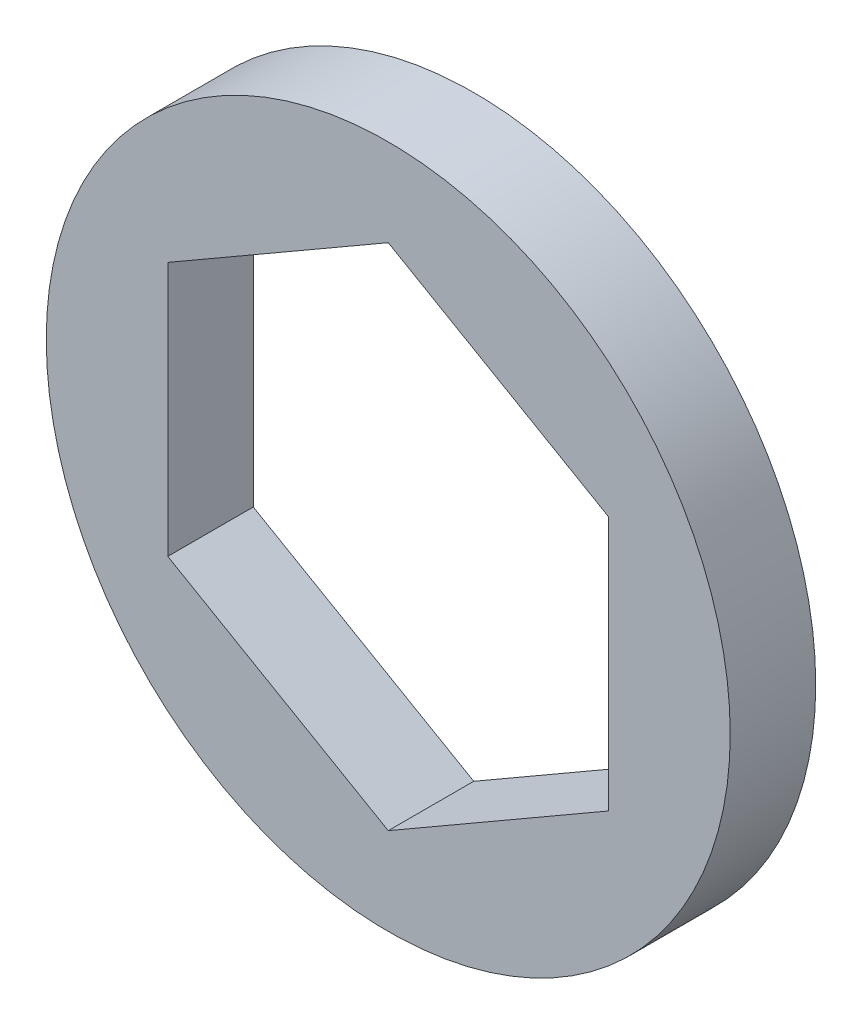
ISO-10303-21;
HEADER;
FILE_DESCRIPTION(('STEP AP214'),'2;1');
FILE_NAME('part.step','',(''),(''),'','','');
FILE_SCHEMA(('AUTOMOTIVE_DESIGN { 1 0 10303 214 1 1 1 1 }'));
ENDSEC;
DATA;
#1=APPLICATION_CONTEXT('core data for automotive mechanical design processes');
#2=APPLICATION_PROTOCOL_DEFINITION('international standard','automotive_design',2000,#1);
#3=PRODUCT_CONTEXT('',#1,'mechanical');
#4=PRODUCT('Part','Part','',(#3));
#5=PRODUCT_RELATED_PRODUCT_CATEGORY('part','',(#4));
#6=PRODUCT_DEFINITION_FORMATION('','',#4);
#7=PRODUCT_DEFINITION_CONTEXT('part definition',#1,'design');
#8=PRODUCT_DEFINITION('design','',#6,#7);
#9=PRODUCT_DEFINITION_SHAPE('','',#8);
#10=(LENGTH_UNIT() NAMED_UNIT(*) SI_UNIT(.MILLI.,.METRE.));
#11=(NAMED_UNIT(*) PLANE_ANGLE_UNIT() SI_UNIT($,.RADIAN.));
#12=(NAMED_UNIT(*) SI_UNIT($,.STERADIAN.) SOLID_ANGLE_UNIT());
#13=UNCERTAINTY_MEASURE_WITH_UNIT(LENGTH_MEASURE(1.E-05),#10,'distance_accuracy_value','');
#14=(GEOMETRIC_REPRESENTATION_CONTEXT(3) GLOBAL_UNCERTAINTY_ASSIGNED_CONTEXT((#13)) GLOBAL_UNIT_ASSIGNED_CONTEXT((#10,
#11,#12)) REPRESENTATION_CONTEXT('',''));
#15=CARTESIAN_POINT('',(0.,0.,0.));
#16=DIRECTION('',(0.,0.,1.));
#17=DIRECTION('',(1.,0.,0.));
#18=AXIS2_PLACEMENT_3D('',#15,#16,#17);
#19=CARTESIAN_POINT('',(0.,0.,2.54));
#20=DIRECTION('',(0.,0.,1.));
#21=DIRECTION('',(1.,0.,0.));
#22=AXIS2_PLACEMENT_3D('',#19,#20,#21);
#23=PLANE('',#22);
#24=CARTESIAN_POINT('',(0.,0.,2.54));
#25=DIRECTION('',(0.,0.,1.));
#26=DIRECTION('',(1.,0.,0.));
#27=AXIS2_PLACEMENT_3D('',#24,#25,#26);
#28=CIRCLE('',#27,10.16);
#29=CARTESIAN_POINT('',(10.16,0.,2.54));
#30=VERTEX_POINT('',#29);
#31=EDGE_CURVE('E11',#30,#30,#28,.T.);
#32=ORIENTED_EDGE('',*,*,#31,.T.);
#33=EDGE_LOOP('',(#32));
#34=FACE_BOUND('',#33,.T.);
#35=DIRECTION('',(-0.866025403784439,-0.5,0.));
#36=VECTOR('',#35,1.);
#37=CARTESIAN_POINT('',(0.,7.5632885263841,2.54));
#38=LINE('',#37,#36);
#39=CARTESIAN_POINT('',(0.,7.5632885263841,2.54));
#40=VERTEX_POINT('',#39);
#41=CARTESIAN_POINT('',(-6.55,3.78164426319205,2.54));
#42=VERTEX_POINT('',#41);
#43=EDGE_CURVE('E102',#40,#42,#38,.T.);
#44=ORIENTED_EDGE('',*,*,#43,.F.);
#45=DIRECTION('',(-0.866025403784439,0.5,0.));
#46=VECTOR('',#45,1.);
#47=CARTESIAN_POINT('',(6.55,3.78164426319205,2.54));
#48=LINE('',#47,#46);
#49=CARTESIAN_POINT('',(6.55,3.78164426319205,2.54));
#50=VERTEX_POINT('',#49);
#51=EDGE_CURVE('E93',#50,#40,#48,.T.);
#52=ORIENTED_EDGE('',*,*,#51,.F.);
#53=DIRECTION('',(0.,1.,0.));
#54=VECTOR('',#53,1.);
#55=CARTESIAN_POINT('',(6.55,-3.78164426319205,2.54));
#56=LINE('',#55,#54);
#57=CARTESIAN_POINT('',(6.55,-3.78164426319205,2.54));
#58=VERTEX_POINT('',#57);
#59=EDGE_CURVE('E127',#58,#50,#56,.T.);
#60=ORIENTED_EDGE('',*,*,#59,.F.);
#61=DIRECTION('',(0.866025403784439,0.5,0.));
#62=VECTOR('',#61,1.);
#63=CARTESIAN_POINT('',(0.,-7.5632885263841,2.54));
#64=LINE('',#63,#62);
#65=CARTESIAN_POINT('',(0.,-7.5632885263841,2.54));
#66=VERTEX_POINT('',#65);
#67=EDGE_CURVE('E124',#66,#58,#64,.T.);
#68=ORIENTED_EDGE('',*,*,#67,.F.);
#69=DIRECTION('',(0.866025403784438,-0.5,0.));
#70=VECTOR('',#69,1.);
#71=CARTESIAN_POINT('',(-6.55000000000001,-3.78164426319205,2.54));
#72=LINE('',#71,#70);
#73=CARTESIAN_POINT('',(-6.55000000000001,-3.78164426319205,2.54));
#74=VERTEX_POINT('',#73);
#75=EDGE_CURVE('E119',#74,#66,#72,.T.);
#76=ORIENTED_EDGE('',*,*,#75,.F.);
#77=DIRECTION('',(0.,-1.,0.));
#78=VECTOR('',#77,1.);
#79=CARTESIAN_POINT('',(-6.55,3.78164426319205,2.54));
#80=LINE('',#79,#78);
#81=EDGE_CURVE('E115',#42,#74,#80,.T.);
#82=ORIENTED_EDGE('',*,*,#81,.F.);
#83=EDGE_LOOP('',(#44,#52,#60,#68,#76,#82));
#84=FACE_BOUND('',#83,.T.);
#85=ADVANCED_FACE('F39',(#34,#84),#23,.T.);
#86=CARTESIAN_POINT('',(0.,0.,0.));
#87=DIRECTION('',(0.,0.,1.));
#88=DIRECTION('',(1.,0.,0.));
#89=AXIS2_PLACEMENT_3D('',#86,#87,#88);
#90=PLANE('',#89);
#91=CARTESIAN_POINT('',(0.,0.,0.));
#92=DIRECTION('',(0.,0.,1.));
#93=DIRECTION('',(1.,0.,0.));
#94=AXIS2_PLACEMENT_3D('',#91,#92,#93);
#95=CIRCLE('',#94,10.16);
#96=CARTESIAN_POINT('',(10.16,0.,0.));
#97=VERTEX_POINT('',#96);
#98=EDGE_CURVE('E43',#97,#97,#95,.T.);
#99=ORIENTED_EDGE('',*,*,#98,.F.);
#100=EDGE_LOOP('',(#99));
#101=FACE_BOUND('',#100,.T.);
#102=DIRECTION('',(-0.866025403784439,0.5,0.));
#103=VECTOR('',#102,1.);
#104=CARTESIAN_POINT('',(6.55,3.78164426319205,0.));
#105=LINE('',#104,#103);
#106=CARTESIAN_POINT('',(6.55,3.78164426319205,0.));
#107=VERTEX_POINT('',#106);
#108=CARTESIAN_POINT('',(0.,7.5632885263841,0.));
#109=VERTEX_POINT('',#108);
#110=EDGE_CURVE('E63',#107,#109,#105,.T.);
#111=ORIENTED_EDGE('',*,*,#110,.T.);
#112=DIRECTION('',(-0.866025403784439,-0.5,0.));
#113=VECTOR('',#112,1.);
#114=CARTESIAN_POINT('',(0.,7.5632885263841,0.));
#115=LINE('',#114,#113);
#116=CARTESIAN_POINT('',(-6.55,3.78164426319205,0.));
#117=VERTEX_POINT('',#116);
#118=EDGE_CURVE('E109',#109,#117,#115,.T.);
#119=ORIENTED_EDGE('',*,*,#118,.T.);
#120=DIRECTION('',(0.,-1.,0.));
#121=VECTOR('',#120,1.);
#122=CARTESIAN_POINT('',(-6.55,3.78164426319205,0.));
#123=LINE('',#122,#121);
#124=CARTESIAN_POINT('',(-6.55000000000001,-3.78164426319205,0.));
#125=VERTEX_POINT('',#124);
#126=EDGE_CURVE('E134',#117,#125,#123,.T.);
#127=ORIENTED_EDGE('',*,*,#126,.T.);
#128=DIRECTION('',(0.866025403784438,-0.5,0.));
#129=VECTOR('',#128,1.);
#130=CARTESIAN_POINT('',(-6.55000000000001,-3.78164426319205,0.));
#131=LINE('',#130,#129);
#132=CARTESIAN_POINT('',(0.,-7.5632885263841,0.));
#133=VERTEX_POINT('',#132);
#134=EDGE_CURVE('E138',#125,#133,#131,.T.);
#135=ORIENTED_EDGE('',*,*,#134,.T.);
#136=DIRECTION('',(0.866025403784439,0.5,0.));
#137=VECTOR('',#136,1.);
#138=CARTESIAN_POINT('',(0.,-7.5632885263841,0.));
#139=LINE('',#138,#137);
#140=CARTESIAN_POINT('',(6.55,-3.78164426319205,0.));
#141=VERTEX_POINT('',#140);
#142=EDGE_CURVE('E142',#133,#141,#139,.T.);
#143=ORIENTED_EDGE('',*,*,#142,.T.);
#144=DIRECTION('',(0.,1.,0.));
#145=VECTOR('',#144,1.);
#146=CARTESIAN_POINT('',(6.55,-3.78164426319205,0.));
#147=LINE('',#146,#145);
#148=EDGE_CURVE('E103',#141,#107,#147,.T.);
#149=ORIENTED_EDGE('',*,*,#148,.T.);
#150=EDGE_LOOP('',(#111,#119,#127,#135,#143,#149));
#151=FACE_BOUND('',#150,.T.);
#152=ADVANCED_FACE('F166',(#101,#151),#90,.F.);
#153=CARTESIAN_POINT('',(0.,0.,2.54));
#154=DIRECTION('',(0.,0.,-1.));
#155=DIRECTION('',(-1.,0.,0.));
#156=AXIS2_PLACEMENT_3D('',#153,#154,#155);
#157=CYLINDRICAL_SURFACE('',#156,10.16);
#158=ORIENTED_EDGE('',*,*,#31,.F.);
#159=EDGE_LOOP('',(#158));
#160=FACE_BOUND('',#159,.T.);
#161=ORIENTED_EDGE('',*,*,#98,.T.);
#162=EDGE_LOOP('',(#161));
#163=FACE_BOUND('',#162,.T.);
#164=ADVANCED_FACE('F41',(#160,#163),#157,.T.);
#165=CARTESIAN_POINT('',(6.55,3.78164426319205,2.54));
#166=DIRECTION('',(-0.5,-0.866025403784439,0.));
#167=DIRECTION('',(0.866025403784439,-0.5,0.));
#168=AXIS2_PLACEMENT_3D('',#165,#166,#167);
#169=PLANE('',#168);
#170=ORIENTED_EDGE('',*,*,#110,.F.);
#171=DIRECTION('',(0.,0.,-1.));
#172=VECTOR('',#171,1.);
#173=CARTESIAN_POINT('',(6.55,3.78164426319205,2.54));
#174=LINE('',#173,#172);
#175=EDGE_CURVE('E97',#50,#107,#174,.T.);
#176=ORIENTED_EDGE('',*,*,#175,.F.);
#177=ORIENTED_EDGE('',*,*,#51,.T.);
#178=DIRECTION('',(0.,0.,-1.));
#179=VECTOR('',#178,1.);
#180=CARTESIAN_POINT('',(0.,7.5632885263841,2.54));
#181=LINE('',#180,#179);
#182=EDGE_CURVE('E96',#40,#109,#181,.T.);
#183=ORIENTED_EDGE('',*,*,#182,.T.);
#184=EDGE_LOOP('',(#170,#176,#177,#183));
#185=FACE_BOUND('',#184,.T.);
#186=ADVANCED_FACE('F95',(#185),#169,.T.);
#187=CARTESIAN_POINT('',(0.,7.5632885263841,2.54));
#188=DIRECTION('',(0.5,-0.866025403784439,0.));
#189=DIRECTION('',(0.866025403784439,0.5,0.));
#190=AXIS2_PLACEMENT_3D('',#187,#188,#189);
#191=PLANE('',#190);
#192=ORIENTED_EDGE('',*,*,#118,.F.);
#193=ORIENTED_EDGE('',*,*,#182,.F.);
#194=ORIENTED_EDGE('',*,*,#43,.T.);
#195=DIRECTION('',(0.,0.,-1.));
#196=VECTOR('',#195,1.);
#197=CARTESIAN_POINT('',(-6.55,3.78164426319205,2.54));
#198=LINE('',#197,#196);
#199=EDGE_CURVE('E111',#42,#117,#198,.T.);
#200=ORIENTED_EDGE('',*,*,#199,.T.);
#201=EDGE_LOOP('',(#192,#193,#194,#200));
#202=FACE_BOUND('',#201,.T.);
#203=ADVANCED_FACE('F106',(#202),#191,.T.);
#204=CARTESIAN_POINT('',(-6.55,3.78164426319205,2.54));
#205=DIRECTION('',(1.,0.,0.));
#206=DIRECTION('',(0.,1.,0.));
#207=AXIS2_PLACEMENT_3D('',#204,#205,#206);
#208=PLANE('',#207);
#209=ORIENTED_EDGE('',*,*,#126,.F.);
#210=ORIENTED_EDGE('',*,*,#199,.F.);
#211=ORIENTED_EDGE('',*,*,#81,.T.);
#212=DIRECTION('',(0.,0.,-1.));
#213=VECTOR('',#212,1.);
#214=CARTESIAN_POINT('',(-6.55000000000001,-3.78164426319205,2.54));
#215=LINE('',#214,#213);
#216=EDGE_CURVE('E156',#74,#125,#215,.T.);
#217=ORIENTED_EDGE('',*,*,#216,.T.);
#218=EDGE_LOOP('',(#209,#210,#211,#217));
#219=FACE_BOUND('',#218,.T.);
#220=ADVANCED_FACE('F162',(#219),#208,.T.);
#221=CARTESIAN_POINT('',(-6.55000000000001,-3.78164426319205,2.54));
#222=DIRECTION('',(0.5,0.866025403784438,0.));
#223=DIRECTION('',(-0.866025403784439,0.5,0.));
#224=AXIS2_PLACEMENT_3D('',#221,#222,#223);
#225=PLANE('',#224);
#226=ORIENTED_EDGE('',*,*,#134,.F.);
#227=ORIENTED_EDGE('',*,*,#216,.F.);
#228=ORIENTED_EDGE('',*,*,#75,.T.);
#229=DIRECTION('',(0.,0.,-1.));
#230=VECTOR('',#229,1.);
#231=CARTESIAN_POINT('',(0.,-7.5632885263841,2.54));
#232=LINE('',#231,#230);
#233=EDGE_CURVE('E153',#66,#133,#232,.T.);
#234=ORIENTED_EDGE('',*,*,#233,.T.);
#235=EDGE_LOOP('',(#226,#227,#228,#234));
#236=FACE_BOUND('',#235,.T.);
#237=ADVANCED_FACE('F174',(#236),#225,.T.);
#238=CARTESIAN_POINT('',(0.,-7.5632885263841,2.54));
#239=DIRECTION('',(-0.5,0.866025403784439,0.));
#240=DIRECTION('',(-0.866025403784439,-0.5,0.));
#241=AXIS2_PLACEMENT_3D('',#238,#239,#240);
#242=PLANE('',#241);
#243=ORIENTED_EDGE('',*,*,#142,.F.);
#244=ORIENTED_EDGE('',*,*,#233,.F.);
#245=ORIENTED_EDGE('',*,*,#67,.T.);
#246=DIRECTION('',(0.,0.,-1.));
#247=VECTOR('',#246,1.);
#248=CARTESIAN_POINT('',(6.55,-3.78164426319205,2.54));
#249=LINE('',#248,#247);
#250=EDGE_CURVE('E55',#58,#141,#249,.T.);
#251=ORIENTED_EDGE('',*,*,#250,.T.);
#252=EDGE_LOOP('',(#243,#244,#245,#251));
#253=FACE_BOUND('',#252,.T.);
#254=ADVANCED_FACE('F172',(#253),#242,.T.);
#255=CARTESIAN_POINT('',(6.55,-3.78164426319205,2.54));
#256=DIRECTION('',(-1.,0.,0.));
#257=DIRECTION('',(0.,-1.,0.));
#258=AXIS2_PLACEMENT_3D('',#255,#256,#257);
#259=PLANE('',#258);
#260=ORIENTED_EDGE('',*,*,#148,.F.);
#261=ORIENTED_EDGE('',*,*,#250,.F.);
#262=ORIENTED_EDGE('',*,*,#59,.T.);
#263=ORIENTED_EDGE('',*,*,#175,.T.);
#264=EDGE_LOOP('',(#260,#261,#262,#263));
#265=FACE_BOUND('',#264,.T.);
#266=ADVANCED_FACE('F168',(#265),#259,.T.);
#267=CLOSED_SHELL('',(#85,#152,#164,#186,#203,#220,#237,#254,#266));
#268=MANIFOLD_SOLID_BREP('B2',#267);
#269=ADVANCED_BREP_SHAPE_REPRESENTATION('',(#18,#268),#14);
#270=SHAPE_DEFINITION_REPRESENTATION(#9,#269);
ENDSEC;
END-ISO-10303-21;
